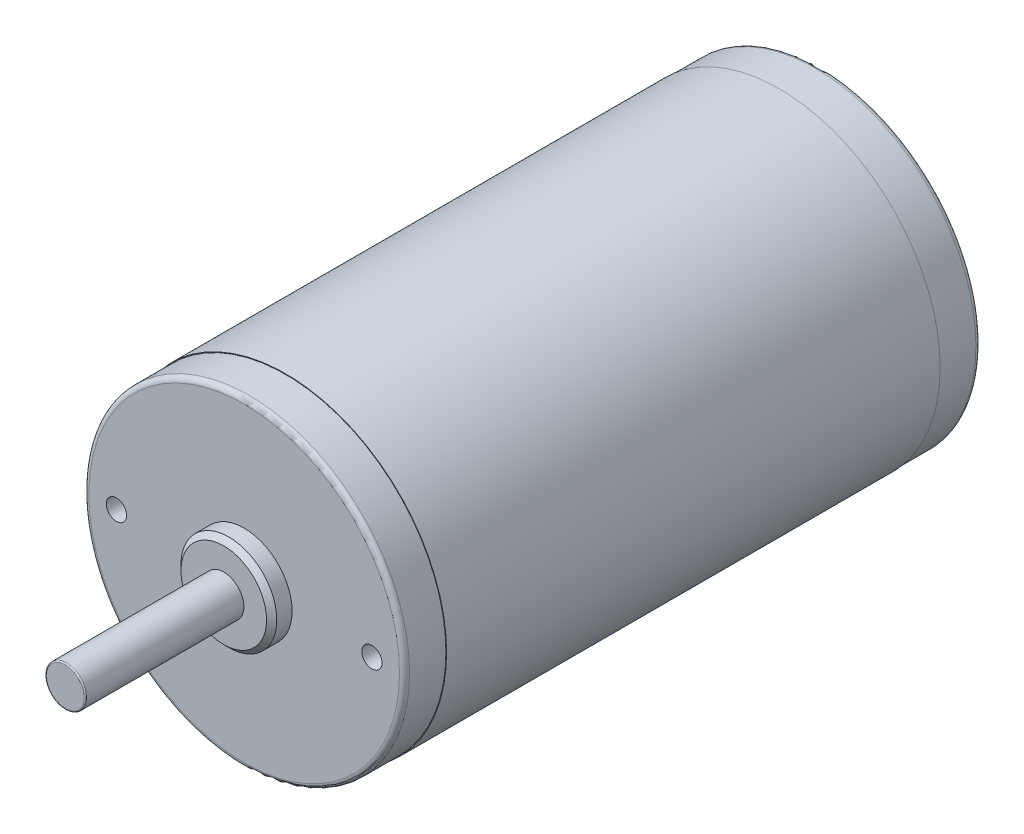
ISO-10303-21;
HEADER;
FILE_DESCRIPTION(('STEP AP214'),'2;1');
FILE_NAME('part.step','',(''),(''),'','','');
FILE_SCHEMA(('AUTOMOTIVE_DESIGN { 1 0 10303 214 1 1 1 1 }'));
ENDSEC;
DATA;
#1=APPLICATION_CONTEXT('core data for automotive mechanical design processes');
#2=APPLICATION_PROTOCOL_DEFINITION('international standard','automotive_design',2000,#1);
#3=PRODUCT_CONTEXT('',#1,'mechanical');
#4=PRODUCT('Part','Part','',(#3));
#5=PRODUCT_RELATED_PRODUCT_CATEGORY('part','',(#4));
#6=PRODUCT_DEFINITION_FORMATION('','',#4);
#7=PRODUCT_DEFINITION_CONTEXT('part definition',#1,'design');
#8=PRODUCT_DEFINITION('design','',#6,#7);
#9=PRODUCT_DEFINITION_SHAPE('','',#8);
#10=(LENGTH_UNIT() NAMED_UNIT(*) SI_UNIT(.MILLI.,.METRE.));
#11=(NAMED_UNIT(*) PLANE_ANGLE_UNIT() SI_UNIT($,.RADIAN.));
#12=(NAMED_UNIT(*) SI_UNIT($,.STERADIAN.) SOLID_ANGLE_UNIT());
#13=UNCERTAINTY_MEASURE_WITH_UNIT(LENGTH_MEASURE(1.E-05),#10,'distance_accuracy_value','');
#14=(GEOMETRIC_REPRESENTATION_CONTEXT(3) GLOBAL_UNCERTAINTY_ASSIGNED_CONTEXT((#13)) GLOBAL_UNIT_ASSIGNED_CONTEXT((#10,
#11,#12)) REPRESENTATION_CONTEXT('',''));
#15=CARTESIAN_POINT('',(0.,0.,0.));
#16=DIRECTION('',(0.,0.,1.));
#17=DIRECTION('',(1.,0.,0.));
#18=AXIS2_PLACEMENT_3D('',#15,#16,#17);
#19=CARTESIAN_POINT('',(35.56,109.2962,-95.554799999998));
#20=DIRECTION('',(0.,0.,-1.));
#21=DIRECTION('',(-1.,0.,0.));
#22=AXIS2_PLACEMENT_3D('',#19,#20,#21);
#23=PLANE('',#22);
#24=CARTESIAN_POINT('',(35.56,109.2962,-95.554799999998));
#25=DIRECTION('',(0.,0.,-1.));
#26=DIRECTION('',(-1.,0.,0.));
#27=AXIS2_PLACEMENT_3D('',#24,#25,#26);
#28=CIRCLE('',#27,30.8770000000005);
#29=CARTESIAN_POINT('',(4.6829999999995,109.2962,-95.554799999998));
#30=VERTEX_POINT('',#29);
#31=EDGE_CURVE('E127',#30,#30,#28,.T.);
#32=ORIENTED_EDGE('',*,*,#31,.T.);
#33=EDGE_LOOP('',(#32));
#34=FACE_BOUND('',#33,.T.);
#35=CARTESIAN_POINT('',(35.56,109.2962,-95.554799999998));
#36=DIRECTION('',(0.,0.,-1.));
#37=DIRECTION('',(-1.,0.,0.));
#38=AXIS2_PLACEMENT_3D('',#35,#36,#37);
#39=CIRCLE('',#38,15.0368000000003);
#40=CARTESIAN_POINT('',(20.5231999999997,109.2962,-95.554799999998));
#41=VERTEX_POINT('',#40);
#42=EDGE_CURVE('E84',#41,#41,#39,.T.);
#43=ORIENTED_EDGE('',*,*,#42,.F.);
#44=EDGE_LOOP('',(#43));
#45=FACE_BOUND('',#44,.T.);
#46=ADVANCED_FACE('F42',(#34,#45),#23,.T.);
#47=CARTESIAN_POINT('',(35.56,109.2962,-87.325199999998));
#48=DIRECTION('',(0.,0.,-1.));
#49=DIRECTION('',(-1.,0.,0.));
#50=AXIS2_PLACEMENT_3D('',#47,#48,#49);
#51=PLANE('',#50);
#52=CARTESIAN_POINT('',(35.56,109.2962,-87.325199999998));
#53=DIRECTION('',(0.,0.,-1.));
#54=DIRECTION('',(-1.,0.,0.));
#55=AXIS2_PLACEMENT_3D('',#52,#53,#54);
#56=CIRCLE('',#55,32.0040000000005);
#57=CARTESIAN_POINT('',(3.5559999999995,109.2962,-87.325199999998));
#58=VERTEX_POINT('',#57);
#59=EDGE_CURVE('E100',#58,#58,#56,.T.);
#60=ORIENTED_EDGE('',*,*,#59,.T.);
#61=EDGE_LOOP('',(#60));
#62=FACE_BOUND('',#61,.T.);
#63=CARTESIAN_POINT('',(35.56,109.2962,-87.325199999998));
#64=DIRECTION('',(0.,0.,-1.));
#65=DIRECTION('',(-1.,0.,0.));
#66=AXIS2_PLACEMENT_3D('',#63,#64,#65);
#67=CIRCLE('',#66,31.8770000000005);
#68=CARTESIAN_POINT('',(3.6829999999995,109.2962,-87.325199999998));
#69=VERTEX_POINT('',#68);
#70=EDGE_CURVE('E88',#69,#69,#67,.T.);
#71=ORIENTED_EDGE('',*,*,#70,.F.);
#72=EDGE_LOOP('',(#71));
#73=FACE_BOUND('',#72,.T.);
#74=ADVANCED_FACE('F158',(#62,#73),#51,.T.);
#75=CARTESIAN_POINT('',(35.56,109.2962,23.114));
#76=DIRECTION('',(0.,0.,1.));
#77=DIRECTION('',(1.,0.,0.));
#78=AXIS2_PLACEMENT_3D('',#75,#76,#77);
#79=PLANE('',#78);
#80=CARTESIAN_POINT('',(35.56,109.2962,23.114));
#81=DIRECTION('',(0.,0.,1.));
#82=DIRECTION('',(1.,0.,0.));
#83=AXIS2_PLACEMENT_3D('',#80,#81,#82);
#84=CIRCLE('',#83,8.50900000182338);
#85=CARTESIAN_POINT('',(44.0690000018234,109.2962,23.114));
#86=VERTEX_POINT('',#85);
#87=EDGE_CURVE('E115',#86,#86,#84,.T.);
#88=ORIENTED_EDGE('',*,*,#87,.T.);
#89=EDGE_LOOP('',(#88));
#90=FACE_BOUND('',#89,.T.);
#91=CARTESIAN_POINT('',(35.56,109.2962,23.114));
#92=DIRECTION('',(0.,0.,1.));
#93=DIRECTION('',(1.,0.,0.));
#94=AXIS2_PLACEMENT_3D('',#91,#92,#93);
#95=CIRCLE('',#94,4.00000000000007);
#96=CARTESIAN_POINT('',(39.5600000000001,109.2962,23.114));
#97=VERTEX_POINT('',#96);
#98=EDGE_CURVE('E92',#97,#97,#95,.T.);
#99=ORIENTED_EDGE('',*,*,#98,.F.);
#100=EDGE_LOOP('',(#99));
#101=FACE_BOUND('',#100,.T.);
#102=ADVANCED_FACE('F164',(#90,#101),#79,.T.);
#103=CARTESIAN_POINT('',(67.5640000000005,109.2962,10.8204000000007));
#104=DIRECTION('',(0.,0.,1.));
#105=DIRECTION('',(1.,0.,0.));
#106=AXIS2_PLACEMENT_3D('',#103,#104,#105);
#107=PLANE('',#106);
#108=CARTESIAN_POINT('',(35.56,109.2962,10.8204000000007));
#109=DIRECTION('',(0.,0.,-1.));
#110=DIRECTION('',(-1.,0.,0.));
#111=AXIS2_PLACEMENT_3D('',#108,#109,#110);
#112=CIRCLE('',#111,32.0040000000005);
#113=CARTESIAN_POINT('',(3.5559999999995,109.2962,10.8204000000007));
#114=VERTEX_POINT('',#113);
#115=EDGE_CURVE('E104',#114,#114,#112,.T.);
#116=ORIENTED_EDGE('',*,*,#115,.F.);
#117=EDGE_LOOP('',(#116));
#118=FACE_BOUND('',#117,.T.);
#119=CARTESIAN_POINT('',(35.56,109.2962,10.8204000000007));
#120=DIRECTION('',(0.,0.,1.));
#121=DIRECTION('',(1.,0.,0.));
#122=AXIS2_PLACEMENT_3D('',#119,#120,#121);
#123=CIRCLE('',#122,31.8770000000005);
#124=CARTESIAN_POINT('',(67.4370000000005,109.2962,10.8204000000007));
#125=VERTEX_POINT('',#124);
#126=EDGE_CURVE('E96',#125,#125,#123,.T.);
#127=ORIENTED_EDGE('',*,*,#126,.F.);
#128=EDGE_LOOP('',(#127));
#129=FACE_BOUND('',#128,.T.);
#130=ADVANCED_FACE('F187',(#118,#129),#107,.T.);
#131=CARTESIAN_POINT('',(35.56,109.2962,10.8204000000007));
#132=DIRECTION('',(0.,0.,-1.));
#133=DIRECTION('',(-1.,0.,0.));
#134=AXIS2_PLACEMENT_3D('',#131,#132,#133);
#135=CYLINDRICAL_SURFACE('',#134,32.0040000000005);
#136=ORIENTED_EDGE('',*,*,#115,.T.);
#137=EDGE_LOOP('',(#136));
#138=FACE_BOUND('',#137,.T.);
#139=ORIENTED_EDGE('',*,*,#59,.F.);
#140=EDGE_LOOP('',(#139));
#141=FACE_BOUND('',#140,.T.);
#142=ADVANCED_FACE('F198',(#138,#141),#135,.T.);
#143=CARTESIAN_POINT('',(35.56,109.2962,19.05));
#144=DIRECTION('',(0.,0.,-1.));
#145=DIRECTION('',(-1.,0.,0.));
#146=AXIS2_PLACEMENT_3D('',#143,#144,#145);
#147=CYLINDRICAL_SURFACE('',#146,31.8770000000005);
#148=CARTESIAN_POINT('',(35.56,109.2962,18.05));
#149=DIRECTION('',(0.,0.,1.));
#150=DIRECTION('',(1.,0.,0.));
#151=AXIS2_PLACEMENT_3D('',#148,#149,#150);
#152=CIRCLE('',#151,31.8770000000005);
#153=CARTESIAN_POINT('',(67.4370000000005,109.2962,18.05));
#154=VERTEX_POINT('',#153);
#155=EDGE_CURVE('E139',#154,#154,#152,.F.);
#156=ORIENTED_EDGE('',*,*,#155,.T.);
#157=EDGE_LOOP('',(#156));
#158=FACE_BOUND('',#157,.T.);
#159=ORIENTED_EDGE('',*,*,#126,.T.);
#160=EDGE_LOOP('',(#159));
#161=FACE_BOUND('',#160,.T.);
#162=ADVANCED_FACE('F195',(#158,#161),#147,.T.);
#163=CARTESIAN_POINT('',(35.56,109.2962,19.05));
#164=DIRECTION('',(0.,0.,1.));
#165=DIRECTION('',(1.,0.,0.));
#166=AXIS2_PLACEMENT_3D('',#163,#164,#165);
#167=PLANE('',#166);
#168=CARTESIAN_POINT('',(35.56,109.2962,19.05));
#169=DIRECTION('',(0.,0.,1.));
#170=DIRECTION('',(1.,0.,0.));
#171=AXIS2_PLACEMENT_3D('',#168,#169,#170);
#172=CIRCLE('',#171,30.8770000000005);
#173=CARTESIAN_POINT('',(66.4370000000005,109.2962,19.05));
#174=VERTEX_POINT('',#173);
#175=EDGE_CURVE('E135',#174,#174,#172,.T.);
#176=ORIENTED_EDGE('',*,*,#175,.T.);
#177=EDGE_LOOP('',(#176));
#178=FACE_BOUND('',#177,.T.);
#179=CARTESIAN_POINT('',(10.1599999999994,109.2962,19.05));
#180=DIRECTION('',(0.,0.,1.));
#181=DIRECTION('',(1.,0.,0.));
#182=AXIS2_PLACEMENT_3D('',#179,#180,#181);
#183=CIRCLE('',#182,2.01930000000003);
#184=CARTESIAN_POINT('',(12.1792999999994,109.2962,19.05));
#185=VERTEX_POINT('',#184);
#186=EDGE_CURVE('E70',#185,#185,#183,.T.);
#187=ORIENTED_EDGE('',*,*,#186,.F.);
#188=EDGE_LOOP('',(#187));
#189=FACE_BOUND('',#188,.T.);
#190=CARTESIAN_POINT('',(60.96,109.2962,19.05));
#191=DIRECTION('',(0.,0.,1.));
#192=DIRECTION('',(1.,0.,0.));
#193=AXIS2_PLACEMENT_3D('',#190,#191,#192);
#194=CIRCLE('',#193,2.01930000000003);
#195=CARTESIAN_POINT('',(62.9793,109.2962,19.05));
#196=VERTEX_POINT('',#195);
#197=EDGE_CURVE('E69',#196,#196,#194,.T.);
#198=ORIENTED_EDGE('',*,*,#197,.F.);
#199=EDGE_LOOP('',(#198));
#200=FACE_BOUND('',#199,.T.);
#201=CARTESIAN_POINT('',(35.56,109.2962,19.05));
#202=DIRECTION('',(0.,0.,1.));
#203=DIRECTION('',(1.,0.,0.));
#204=AXIS2_PLACEMENT_3D('',#201,#202,#203);
#205=CIRCLE('',#204,9.52500000000019);
#206=CARTESIAN_POINT('',(45.0850000000002,109.2962,19.05));
#207=VERTEX_POINT('',#206);
#208=EDGE_CURVE('E107',#207,#207,#205,.T.);
#209=ORIENTED_EDGE('',*,*,#208,.F.);
#210=EDGE_LOOP('',(#209));
#211=FACE_BOUND('',#210,.T.);
#212=ADVANCED_FACE('F191',(#178,#189,#200,#211),#167,.T.);
#213=CARTESIAN_POINT('',(35.56,109.2962,23.114));
#214=DIRECTION('',(0.,0.,-1.));
#215=DIRECTION('',(-1.,0.,0.));
#216=AXIS2_PLACEMENT_3D('',#213,#214,#215);
#217=CYLINDRICAL_SURFACE('',#216,9.52500000000019);
#218=CARTESIAN_POINT('',(35.56,109.2962,22.0979999999996));
#219=DIRECTION('',(0.,0.,1.));
#220=DIRECTION('',(1.,0.,0.));
#221=AXIS2_PLACEMENT_3D('',#218,#219,#220);
#222=CIRCLE('',#221,9.52500000000019);
#223=CARTESIAN_POINT('',(45.0850000000002,109.2962,22.0979999999996));
#224=VERTEX_POINT('',#223);
#225=EDGE_CURVE('E111',#224,#224,#222,.F.);
#226=ORIENTED_EDGE('',*,*,#225,.T.);
#227=EDGE_LOOP('',(#226));
#228=FACE_BOUND('',#227,.T.);
#229=ORIENTED_EDGE('',*,*,#208,.T.);
#230=EDGE_LOOP('',(#229));
#231=FACE_BOUND('',#230,.T.);
#232=ADVANCED_FACE('F183',(#228,#231),#217,.T.);
#233=CARTESIAN_POINT('',(35.56,109.2962,54.614));
#234=DIRECTION('',(0.,0.,-1.));
#235=DIRECTION('',(-1.,0.,0.));
#236=AXIS2_PLACEMENT_3D('',#233,#234,#235);
#237=CYLINDRICAL_SURFACE('',#236,4.00000000000007);
#238=CARTESIAN_POINT('',(35.56,109.2962,54.36));
#239=DIRECTION('',(0.,0.,1.));
#240=DIRECTION('',(1.,0.,0.));
#241=AXIS2_PLACEMENT_3D('',#238,#239,#240);
#242=CIRCLE('',#241,4.00000000000007);
#243=CARTESIAN_POINT('',(39.5600000000001,109.2962,54.36));
#244=VERTEX_POINT('',#243);
#245=EDGE_CURVE('E123',#244,#244,#242,.F.);
#246=ORIENTED_EDGE('',*,*,#245,.T.);
#247=EDGE_LOOP('',(#246));
#248=FACE_BOUND('',#247,.T.);
#249=ORIENTED_EDGE('',*,*,#98,.T.);
#250=EDGE_LOOP('',(#249));
#251=FACE_BOUND('',#250,.T.);
#252=ADVANCED_FACE('F179',(#248,#251),#237,.T.);
#253=CARTESIAN_POINT('',(35.56,109.2962,54.614));
#254=DIRECTION('',(0.,0.,1.));
#255=DIRECTION('',(1.,0.,0.));
#256=AXIS2_PLACEMENT_3D('',#253,#254,#255);
#257=PLANE('',#256);
#258=CARTESIAN_POINT('',(35.56,109.2962,54.614));
#259=DIRECTION('',(0.,0.,1.));
#260=DIRECTION('',(1.,0.,0.));
#261=AXIS2_PLACEMENT_3D('',#258,#259,#260);
#262=CIRCLE('',#261,3.74600000000007);
#263=CARTESIAN_POINT('',(39.3060000000001,109.2962,54.614));
#264=VERTEX_POINT('',#263);
#265=EDGE_CURVE('E119',#264,#264,#262,.T.);
#266=ORIENTED_EDGE('',*,*,#265,.T.);
#267=EDGE_LOOP('',(#266));
#268=FACE_BOUND('',#267,.T.);
#269=ADVANCED_FACE('F175',(#268),#257,.T.);
#270=CARTESIAN_POINT('',(35.56,109.2962,-95.554799999998));
#271=DIRECTION('',(0.,0.,1.));
#272=DIRECTION('',(1.,0.,0.));
#273=AXIS2_PLACEMENT_3D('',#270,#271,#272);
#274=CYLINDRICAL_SURFACE('',#273,31.8770000000005);
#275=CARTESIAN_POINT('',(35.56,109.2962,-94.554799999998));
#276=DIRECTION('',(0.,0.,-1.));
#277=DIRECTION('',(-1.,0.,0.));
#278=AXIS2_PLACEMENT_3D('',#275,#276,#277);
#279=CIRCLE('',#278,31.8770000000005);
#280=CARTESIAN_POINT('',(3.6829999999995,109.2962,-94.554799999998));
#281=VERTEX_POINT('',#280);
#282=EDGE_CURVE('E131',#281,#281,#279,.F.);
#283=ORIENTED_EDGE('',*,*,#282,.T.);
#284=EDGE_LOOP('',(#283));
#285=FACE_BOUND('',#284,.T.);
#286=ORIENTED_EDGE('',*,*,#70,.T.);
#287=EDGE_LOOP('',(#286));
#288=FACE_BOUND('',#287,.T.);
#289=ADVANCED_FACE('F172',(#285,#288),#274,.T.);
#290=CARTESIAN_POINT('',(35.56,109.2962,-100.317299999998));
#291=DIRECTION('',(0.,0.,1.));
#292=DIRECTION('',(1.,0.,0.));
#293=AXIS2_PLACEMENT_3D('',#290,#291,#292);
#294=CYLINDRICAL_SURFACE('',#293,15.0368000000003);
#295=CARTESIAN_POINT('',(35.56,109.2962,-99.317299999998));
#296=DIRECTION('',(0.,0.,-1.));
#297=DIRECTION('',(-1.,0.,0.));
#298=AXIS2_PLACEMENT_3D('',#295,#296,#297);
#299=CIRCLE('',#298,15.0368000000003);
#300=CARTESIAN_POINT('',(20.5231999999997,109.2962,-99.317299999998));
#301=VERTEX_POINT('',#300);
#302=EDGE_CURVE('E11',#301,#301,#299,.F.);
#303=ORIENTED_EDGE('',*,*,#302,.T.);
#304=EDGE_LOOP('',(#303));
#305=FACE_BOUND('',#304,.T.);
#306=ORIENTED_EDGE('',*,*,#42,.T.);
#307=EDGE_LOOP('',(#306));
#308=FACE_BOUND('',#307,.T.);
#309=ADVANCED_FACE('F170',(#305,#308),#294,.T.);
#310=CARTESIAN_POINT('',(35.56,109.2962,-100.317299999998));
#311=DIRECTION('',(0.,0.,-1.));
#312=DIRECTION('',(-1.,0.,0.));
#313=AXIS2_PLACEMENT_3D('',#310,#311,#312);
#314=PLANE('',#313);
#315=CARTESIAN_POINT('',(35.56,109.2962,-100.317299999998));
#316=DIRECTION('',(0.,0.,-1.));
#317=DIRECTION('',(-1.,0.,0.));
#318=AXIS2_PLACEMENT_3D('',#315,#316,#317);
#319=CIRCLE('',#318,14.0368000000003);
#320=CARTESIAN_POINT('',(21.5231999999997,109.2962,-100.317299999998));
#321=VERTEX_POINT('',#320);
#322=EDGE_CURVE('E51',#321,#321,#319,.T.);
#323=ORIENTED_EDGE('',*,*,#322,.T.);
#324=EDGE_LOOP('',(#323));
#325=FACE_BOUND('',#324,.T.);
#326=ADVANCED_FACE('F146',(#325),#314,.T.);
#327=CARTESIAN_POINT('',(60.96,109.2962,5.43560000000074));
#328=DIRECTION('',(0.,0.,1.));
#329=DIRECTION('',(1.,0.,0.));
#330=AXIS2_PLACEMENT_3D('',#327,#328,#329);
#331=CONICAL_SURFACE('',#330,2.01930000000003,1.0297442575);
#332=CARTESIAN_POINT('',(60.96,109.2962,4.22228214876452));
#333=VERTEX_POINT('',#332);
#334=VERTEX_LOOP('',#333);
#335=FACE_BOUND('',#334,.T.);
#336=CARTESIAN_POINT('',(60.96,109.2962,5.43560000000074));
#337=DIRECTION('',(0.,0.,1.));
#338=DIRECTION('',(1.,0.,0.));
#339=AXIS2_PLACEMENT_3D('',#336,#337,#338);
#340=CIRCLE('',#339,2.01930000000003);
#341=CARTESIAN_POINT('',(62.9793,109.2962,5.43560000000074));
#342=VERTEX_POINT('',#341);
#343=EDGE_CURVE('E75',#342,#342,#340,.T.);
#344=ORIENTED_EDGE('',*,*,#343,.T.);
#345=EDGE_LOOP('',(#344));
#346=FACE_BOUND('',#345,.T.);
#347=ADVANCED_FACE('F265',(#335,#346),#331,.F.);
#348=CARTESIAN_POINT('',(60.96,109.2962,19.05));
#349=DIRECTION('',(0.,0.,1.));
#350=DIRECTION('',(1.,0.,0.));
#351=AXIS2_PLACEMENT_3D('',#348,#349,#350);
#352=CYLINDRICAL_SURFACE('',#351,2.01930000000003);
#353=ORIENTED_EDGE('',*,*,#343,.F.);
#354=EDGE_LOOP('',(#353));
#355=FACE_BOUND('',#354,.T.);
#356=ORIENTED_EDGE('',*,*,#197,.T.);
#357=EDGE_LOOP('',(#356));
#358=FACE_BOUND('',#357,.T.);
#359=ADVANCED_FACE('F62',(#355,#358),#352,.F.);
#360=CARTESIAN_POINT('',(10.1599999999994,109.2962,5.4356000000007));
#361=DIRECTION('',(0.,0.,1.));
#362=DIRECTION('',(1.,0.,0.));
#363=AXIS2_PLACEMENT_3D('',#360,#361,#362);
#364=CONICAL_SURFACE('',#363,2.01930000000003,1.0297442575);
#365=CARTESIAN_POINT('',(10.1599999999994,109.2962,4.22228214876447));
#366=VERTEX_POINT('',#365);
#367=VERTEX_LOOP('',#366);
#368=FACE_BOUND('',#367,.T.);
#369=CARTESIAN_POINT('',(10.1599999999994,109.2962,5.4356000000007));
#370=DIRECTION('',(0.,0.,1.));
#371=DIRECTION('',(1.,0.,0.));
#372=AXIS2_PLACEMENT_3D('',#369,#370,#371);
#373=CIRCLE('',#372,2.01930000000003);
#374=CARTESIAN_POINT('',(12.1792999999994,109.2962,5.4356000000007));
#375=VERTEX_POINT('',#374);
#376=EDGE_CURVE('E66',#375,#375,#373,.T.);
#377=ORIENTED_EDGE('',*,*,#376,.T.);
#378=EDGE_LOOP('',(#377));
#379=FACE_BOUND('',#378,.T.);
#380=ADVANCED_FACE('F58',(#368,#379),#364,.F.);
#381=CARTESIAN_POINT('',(10.1599999999994,109.2962,19.05));
#382=DIRECTION('',(0.,0.,1.));
#383=DIRECTION('',(1.,0.,0.));
#384=AXIS2_PLACEMENT_3D('',#381,#382,#383);
#385=CYLINDRICAL_SURFACE('',#384,2.01930000000003);
#386=ORIENTED_EDGE('',*,*,#376,.F.);
#387=EDGE_LOOP('',(#386));
#388=FACE_BOUND('',#387,.T.);
#389=ORIENTED_EDGE('',*,*,#186,.T.);
#390=EDGE_LOOP('',(#389));
#391=FACE_BOUND('',#390,.T.);
#392=ADVANCED_FACE('F61',(#388,#391),#385,.F.);
#393=CARTESIAN_POINT('',(35.56,109.2962,22.0979999999996));
#394=DIRECTION('',(0.,0.,-1.));
#395=DIRECTION('',(-1.,0.,0.));
#396=AXIS2_PLACEMENT_3D('',#393,#394,#395);
#397=CONICAL_SURFACE('',#396,9.52500000000019,0.785398162500005);
#398=ORIENTED_EDGE('',*,*,#87,.F.);
#399=EDGE_LOOP('',(#398));
#400=FACE_BOUND('',#399,.T.);
#401=ORIENTED_EDGE('',*,*,#225,.F.);
#402=EDGE_LOOP('',(#401));
#403=FACE_BOUND('',#402,.T.);
#404=ADVANCED_FACE('F207',(#400,#403),#397,.T.);
#405=CARTESIAN_POINT('',(35.56,109.2962,54.36));
#406=DIRECTION('',(0.,0.,1.));
#407=DIRECTION('',(1.,0.,0.));
#408=AXIS2_PLACEMENT_3D('',#405,#406,#407);
#409=TOROIDAL_SURFACE('',#408,3.74600000000007,0.254);
#410=ORIENTED_EDGE('',*,*,#245,.F.);
#411=EDGE_LOOP('',(#410));
#412=FACE_BOUND('',#411,.T.);
#413=ORIENTED_EDGE('',*,*,#265,.F.);
#414=EDGE_LOOP('',(#413));
#415=FACE_BOUND('',#414,.T.);
#416=ADVANCED_FACE('F210',(#412,#415),#409,.T.);
#417=CARTESIAN_POINT('',(35.56,109.2962,-94.554799999998));
#418=DIRECTION('',(0.,0.,-1.));
#419=DIRECTION('',(-1.,0.,0.));
#420=AXIS2_PLACEMENT_3D('',#417,#418,#419);
#421=TOROIDAL_SURFACE('',#420,30.8770000000005,1.);
#422=ORIENTED_EDGE('',*,*,#282,.F.);
#423=EDGE_LOOP('',(#422));
#424=FACE_BOUND('',#423,.T.);
#425=ORIENTED_EDGE('',*,*,#31,.F.);
#426=EDGE_LOOP('',(#425));
#427=FACE_BOUND('',#426,.T.);
#428=ADVANCED_FACE('F154',(#424,#427),#421,.T.);
#429=CARTESIAN_POINT('',(35.56,109.2962,18.05));
#430=DIRECTION('',(0.,0.,1.));
#431=DIRECTION('',(1.,0.,0.));
#432=AXIS2_PLACEMENT_3D('',#429,#430,#431);
#433=TOROIDAL_SURFACE('',#432,30.8770000000005,1.);
#434=ORIENTED_EDGE('',*,*,#155,.F.);
#435=EDGE_LOOP('',(#434));
#436=FACE_BOUND('',#435,.T.);
#437=ORIENTED_EDGE('',*,*,#175,.F.);
#438=EDGE_LOOP('',(#437));
#439=FACE_BOUND('',#438,.T.);
#440=ADVANCED_FACE('F149',(#436,#439),#433,.T.);
#441=CARTESIAN_POINT('',(35.56,109.2962,-99.317299999998));
#442=DIRECTION('',(0.,0.,-1.));
#443=DIRECTION('',(-1.,0.,0.));
#444=AXIS2_PLACEMENT_3D('',#441,#442,#443);
#445=TOROIDAL_SURFACE('',#444,14.0368000000003,1.);
#446=ORIENTED_EDGE('',*,*,#302,.F.);
#447=EDGE_LOOP('',(#446));
#448=FACE_BOUND('',#447,.T.);
#449=ORIENTED_EDGE('',*,*,#322,.F.);
#450=EDGE_LOOP('',(#449));
#451=FACE_BOUND('',#450,.T.);
#452=ADVANCED_FACE('F44',(#448,#451),#445,.T.);
#453=CLOSED_SHELL('',(#46,#74,#102,#130,#142,#162,#212,#232,#252,#269,#289,#309,#326,#347,#359,
#380,#392,#404,#416,#428,#440,#452));
#454=MANIFOLD_SOLID_BREP('B2',#453);
#455=ADVANCED_BREP_SHAPE_REPRESENTATION('',(#18,#454),#14);
#456=SHAPE_DEFINITION_REPRESENTATION(#9,#455);
ENDSEC;
END-ISO-10303-21;
